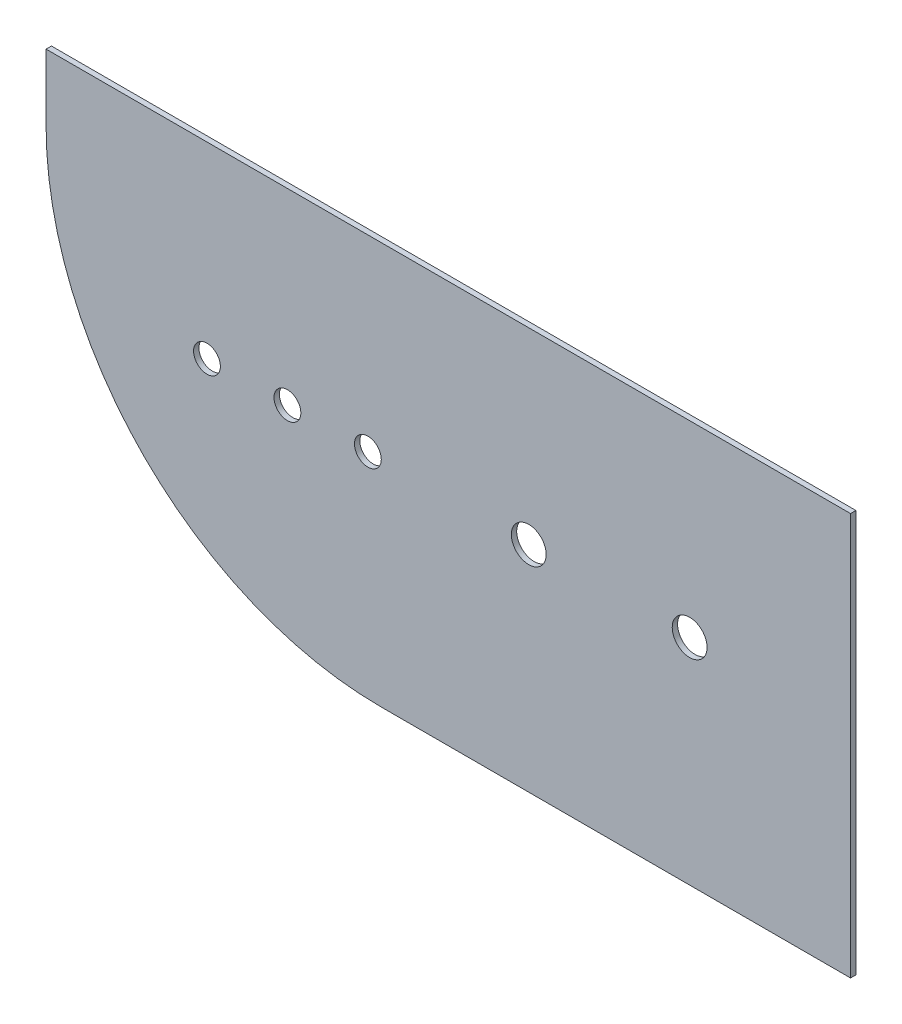
ISO-10303-21;
HEADER;
FILE_DESCRIPTION(('STEP AP214'),'2;1');
FILE_NAME('part.step','',(''),(''),'','','');
FILE_SCHEMA(('AUTOMOTIVE_DESIGN { 1 0 10303 214 1 1 1 1 }'));
ENDSEC;
DATA;
#1=APPLICATION_CONTEXT('core data for automotive mechanical design processes');
#2=APPLICATION_PROTOCOL_DEFINITION('international standard','automotive_design',2000,#1);
#3=PRODUCT_CONTEXT('',#1,'mechanical');
#4=PRODUCT('Part','Part','',(#3));
#5=PRODUCT_RELATED_PRODUCT_CATEGORY('part','',(#4));
#6=PRODUCT_DEFINITION_FORMATION('','',#4);
#7=PRODUCT_DEFINITION_CONTEXT('part definition',#1,'design');
#8=PRODUCT_DEFINITION('design','',#6,#7);
#9=PRODUCT_DEFINITION_SHAPE('','',#8);
#10=(LENGTH_UNIT() NAMED_UNIT(*) SI_UNIT(.MILLI.,.METRE.));
#11=(NAMED_UNIT(*) PLANE_ANGLE_UNIT() SI_UNIT($,.RADIAN.));
#12=(NAMED_UNIT(*) SI_UNIT($,.STERADIAN.) SOLID_ANGLE_UNIT());
#13=UNCERTAINTY_MEASURE_WITH_UNIT(LENGTH_MEASURE(1.E-05),#10,'distance_accuracy_value','');
#14=(GEOMETRIC_REPRESENTATION_CONTEXT(3) GLOBAL_UNCERTAINTY_ASSIGNED_CONTEXT((#13)) GLOBAL_UNIT_ASSIGNED_CONTEXT((#10,
#11,#12)) REPRESENTATION_CONTEXT('',''));
#15=CARTESIAN_POINT('',(0.,0.,0.));
#16=DIRECTION('',(0.,0.,1.));
#17=DIRECTION('',(1.,0.,0.));
#18=AXIS2_PLACEMENT_3D('',#15,#16,#17);
#19=CARTESIAN_POINT('',(-30.,-35.,0.));
#20=DIRECTION('',(0.,0.,1.));
#21=DIRECTION('',(1.,0.,0.));
#22=AXIS2_PLACEMENT_3D('',#19,#20,#21);
#23=CYLINDRICAL_SURFACE('',#22,3.25);
#24=CARTESIAN_POINT('',(-30.,-35.,1.));
#25=DIRECTION('',(0.,0.,-1.));
#26=DIRECTION('',(1.,0.,0.));
#27=AXIS2_PLACEMENT_3D('',#24,#25,#26);
#28=CIRCLE('',#27,3.25);
#29=CARTESIAN_POINT('',(-33.25,-35.,1.));
#30=VERTEX_POINT('',#29);
#31=EDGE_CURVE('E52',#30,#30,#28,.T.);
#32=ORIENTED_EDGE('',*,*,#31,.F.);
#33=DIRECTION('',(0.,0.,-1.));
#34=VECTOR('',#33,1.);
#35=CARTESIAN_POINT('',(-33.25,-35.,0.));
#36=LINE('',#35,#34);
#37=CARTESIAN_POINT('',(-33.25,-35.,0.));
#38=VERTEX_POINT('',#37);
#39=EDGE_CURVE('E11',#30,#38,#36,.T.);
#40=ORIENTED_EDGE('',*,*,#39,.T.);
#41=CARTESIAN_POINT('',(-30.,-35.,0.));
#42=DIRECTION('',(0.,0.,-1.));
#43=DIRECTION('',(1.,0.,0.));
#44=AXIS2_PLACEMENT_3D('',#41,#42,#43);
#45=CIRCLE('',#44,3.25);
#46=EDGE_CURVE('E44',#38,#38,#45,.T.);
#47=ORIENTED_EDGE('',*,*,#46,.T.);
#48=ORIENTED_EDGE('',*,*,#39,.F.);
#49=EDGE_LOOP('',(#32,#40,#47,#48));
#50=FACE_BOUND('',#49,.T.);
#51=ADVANCED_FACE('F34',(#50),#23,.F.);
#52=CARTESIAN_POINT('',(-150.,0.,0.));
#53=DIRECTION('',(-1.,0.,0.));
#54=DIRECTION('',(0.,0.,1.));
#55=AXIS2_PLACEMENT_3D('',#52,#53,#54);
#56=PLANE('',#55);
#57=DIRECTION('',(0.,-1.,0.));
#58=VECTOR('',#57,1.);
#59=CARTESIAN_POINT('',(-150.,0.,0.));
#60=LINE('',#59,#58);
#61=CARTESIAN_POINT('',(-150.,0.,0.));
#62=VERTEX_POINT('',#61);
#63=CARTESIAN_POINT('',(-150.,-12.5,0.));
#64=VERTEX_POINT('',#63);
#65=EDGE_CURVE('E90',#62,#64,#60,.T.);
#66=ORIENTED_EDGE('',*,*,#65,.T.);
#67=DIRECTION('',(0.,0.,1.));
#68=VECTOR('',#67,1.);
#69=CARTESIAN_POINT('',(-150.,-12.5,0.));
#70=LINE('',#69,#68);
#71=CARTESIAN_POINT('',(-150.,-12.5,1.));
#72=VERTEX_POINT('',#71);
#73=EDGE_CURVE('E81',#64,#72,#70,.T.);
#74=ORIENTED_EDGE('',*,*,#73,.T.);
#75=DIRECTION('',(0.,-1.,0.));
#76=VECTOR('',#75,1.);
#77=CARTESIAN_POINT('',(-150.,0.,1.));
#78=LINE('',#77,#76);
#79=CARTESIAN_POINT('',(-150.,0.,1.));
#80=VERTEX_POINT('',#79);
#81=EDGE_CURVE('E132',#80,#72,#78,.T.);
#82=ORIENTED_EDGE('',*,*,#81,.F.);
#83=DIRECTION('',(0.,0.,1.));
#84=VECTOR('',#83,1.);
#85=CARTESIAN_POINT('',(-150.,0.,0.));
#86=LINE('',#85,#84);
#87=EDGE_CURVE('E96',#62,#80,#86,.T.);
#88=ORIENTED_EDGE('',*,*,#87,.F.);
#89=EDGE_LOOP('',(#66,#74,#82,#88));
#90=FACE_BOUND('',#89,.T.);
#91=ADVANCED_FACE('F94',(#90),#56,.T.);
#92=CARTESIAN_POINT('',(0.,0.,0.));
#93=DIRECTION('',(0.,1.,0.));
#94=DIRECTION('',(1.,0.,0.));
#95=AXIS2_PLACEMENT_3D('',#92,#93,#94);
#96=PLANE('',#95);
#97=DIRECTION('',(-1.,0.,0.));
#98=VECTOR('',#97,1.);
#99=CARTESIAN_POINT('',(0.,0.,0.));
#100=LINE('',#99,#98);
#101=CARTESIAN_POINT('',(0.,0.,0.));
#102=VERTEX_POINT('',#101);
#103=EDGE_CURVE('E91',#102,#62,#100,.T.);
#104=ORIENTED_EDGE('',*,*,#103,.T.);
#105=ORIENTED_EDGE('',*,*,#87,.T.);
#106=DIRECTION('',(-1.,0.,0.));
#107=VECTOR('',#106,1.);
#108=CARTESIAN_POINT('',(0.,0.,1.));
#109=LINE('',#108,#107);
#110=CARTESIAN_POINT('',(0.,0.,1.));
#111=VERTEX_POINT('',#110);
#112=EDGE_CURVE('E134',#111,#80,#109,.T.);
#113=ORIENTED_EDGE('',*,*,#112,.F.);
#114=DIRECTION('',(0.,0.,1.));
#115=VECTOR('',#114,1.);
#116=CARTESIAN_POINT('',(0.,0.,0.));
#117=LINE('',#116,#115);
#118=EDGE_CURVE('E121',#102,#111,#117,.T.);
#119=ORIENTED_EDGE('',*,*,#118,.F.);
#120=EDGE_LOOP('',(#104,#105,#113,#119));
#121=FACE_BOUND('',#120,.T.);
#122=ADVANCED_FACE('F146',(#121),#96,.T.);
#123=CARTESIAN_POINT('',(0.,-75.,0.));
#124=DIRECTION('',(1.,0.,0.));
#125=DIRECTION('',(0.,1.,0.));
#126=AXIS2_PLACEMENT_3D('',#123,#124,#125);
#127=PLANE('',#126);
#128=DIRECTION('',(0.,1.,0.));
#129=VECTOR('',#128,1.);
#130=CARTESIAN_POINT('',(0.,-75.,0.));
#131=LINE('',#130,#129);
#132=CARTESIAN_POINT('',(0.,-75.,0.));
#133=VERTEX_POINT('',#132);
#134=EDGE_CURVE('E119',#133,#102,#131,.T.);
#135=ORIENTED_EDGE('',*,*,#134,.T.);
#136=ORIENTED_EDGE('',*,*,#118,.T.);
#137=DIRECTION('',(0.,1.,0.));
#138=VECTOR('',#137,1.);
#139=CARTESIAN_POINT('',(0.,-75.,1.));
#140=LINE('',#139,#138);
#141=CARTESIAN_POINT('',(0.,-75.,1.));
#142=VERTEX_POINT('',#141);
#143=EDGE_CURVE('E38',#142,#111,#140,.T.);
#144=ORIENTED_EDGE('',*,*,#143,.F.);
#145=DIRECTION('',(0.,0.,1.));
#146=VECTOR('',#145,1.);
#147=CARTESIAN_POINT('',(0.,-75.,0.));
#148=LINE('',#147,#146);
#149=EDGE_CURVE('E107',#133,#142,#148,.T.);
#150=ORIENTED_EDGE('',*,*,#149,.F.);
#151=EDGE_LOOP('',(#135,#136,#144,#150));
#152=FACE_BOUND('',#151,.T.);
#153=ADVANCED_FACE('F144',(#152),#127,.T.);
#154=CARTESIAN_POINT('',(-87.5,-75.,0.));
#155=DIRECTION('',(0.,-1.,0.));
#156=DIRECTION('',(-1.,0.,0.));
#157=AXIS2_PLACEMENT_3D('',#154,#155,#156);
#158=PLANE('',#157);
#159=DIRECTION('',(1.,0.,0.));
#160=VECTOR('',#159,1.);
#161=CARTESIAN_POINT('',(-87.5,-75.,0.));
#162=LINE('',#161,#160);
#163=CARTESIAN_POINT('',(-87.5,-75.,0.));
#164=VERTEX_POINT('',#163);
#165=EDGE_CURVE('E106',#164,#133,#162,.T.);
#166=ORIENTED_EDGE('',*,*,#165,.T.);
#167=ORIENTED_EDGE('',*,*,#149,.T.);
#168=DIRECTION('',(1.,0.,0.));
#169=VECTOR('',#168,1.);
#170=CARTESIAN_POINT('',(-87.5,-75.,1.));
#171=LINE('',#170,#169);
#172=CARTESIAN_POINT('',(-87.5,-75.,1.));
#173=VERTEX_POINT('',#172);
#174=EDGE_CURVE('E116',#173,#142,#171,.T.);
#175=ORIENTED_EDGE('',*,*,#174,.F.);
#176=DIRECTION('',(0.,0.,1.));
#177=VECTOR('',#176,1.);
#178=CARTESIAN_POINT('',(-87.5,-75.,0.));
#179=LINE('',#178,#177);
#180=EDGE_CURVE('E108',#164,#173,#179,.T.);
#181=ORIENTED_EDGE('',*,*,#180,.F.);
#182=EDGE_LOOP('',(#166,#167,#175,#181));
#183=FACE_BOUND('',#182,.T.);
#184=ADVANCED_FACE('F142',(#183),#158,.T.);
#185=CARTESIAN_POINT('',(-87.5,-12.5,0.));
#186=DIRECTION('',(0.,0.,1.));
#187=DIRECTION('',(-1.,0.,0.));
#188=AXIS2_PLACEMENT_3D('',#185,#186,#187);
#189=CYLINDRICAL_SURFACE('',#188,62.5);
#190=CARTESIAN_POINT('',(-87.5,-12.5,0.));
#191=DIRECTION('',(0.,0.,1.));
#192=DIRECTION('',(-1.,0.,0.));
#193=AXIS2_PLACEMENT_3D('',#190,#191,#192);
#194=CIRCLE('',#193,62.5);
#195=EDGE_CURVE('E86',#64,#164,#194,.T.);
#196=ORIENTED_EDGE('',*,*,#195,.T.);
#197=ORIENTED_EDGE('',*,*,#180,.T.);
#198=CARTESIAN_POINT('',(-87.5,-12.5,1.));
#199=DIRECTION('',(0.,0.,1.));
#200=DIRECTION('',(-1.,0.,0.));
#201=AXIS2_PLACEMENT_3D('',#198,#199,#200);
#202=CIRCLE('',#201,62.5);
#203=EDGE_CURVE('E88',#72,#173,#202,.T.);
#204=ORIENTED_EDGE('',*,*,#203,.F.);
#205=ORIENTED_EDGE('',*,*,#73,.F.);
#206=EDGE_LOOP('',(#196,#197,#204,#205));
#207=FACE_BOUND('',#206,.T.);
#208=ADVANCED_FACE('F83',(#207),#189,.T.);
#209=CARTESIAN_POINT('',(-75.,-37.5,1.));
#210=DIRECTION('',(0.,0.,1.));
#211=DIRECTION('',(1.,0.,0.));
#212=AXIS2_PLACEMENT_3D('',#209,#210,#211);
#213=PLANE('',#212);
#214=CARTESIAN_POINT('',(-120.,-35.,1.));
#215=DIRECTION('',(0.,0.,1.));
#216=DIRECTION('',(1.,0.,0.));
#217=AXIS2_PLACEMENT_3D('',#214,#215,#216);
#218=CIRCLE('',#217,2.5);
#219=CARTESIAN_POINT('',(-117.5,-35.,1.));
#220=VERTEX_POINT('',#219);
#221=EDGE_CURVE('E205',#220,#220,#218,.T.);
#222=ORIENTED_EDGE('',*,*,#221,.F.);
#223=EDGE_LOOP('',(#222));
#224=FACE_BOUND('',#223,.T.);
#225=CARTESIAN_POINT('',(-105.,-35.,1.));
#226=DIRECTION('',(0.,0.,1.));
#227=DIRECTION('',(1.,0.,0.));
#228=AXIS2_PLACEMENT_3D('',#225,#226,#227);
#229=CIRCLE('',#228,2.50000000000001);
#230=CARTESIAN_POINT('',(-102.5,-35.,1.));
#231=VERTEX_POINT('',#230);
#232=EDGE_CURVE('E202',#231,#231,#229,.T.);
#233=ORIENTED_EDGE('',*,*,#232,.F.);
#234=EDGE_LOOP('',(#233));
#235=FACE_BOUND('',#234,.T.);
#236=CARTESIAN_POINT('',(-90.,-35.,1.));
#237=DIRECTION('',(0.,0.,1.));
#238=DIRECTION('',(1.,0.,0.));
#239=AXIS2_PLACEMENT_3D('',#236,#237,#238);
#240=CIRCLE('',#239,2.5);
#241=CARTESIAN_POINT('',(-87.5,-35.,1.));
#242=VERTEX_POINT('',#241);
#243=EDGE_CURVE('E197',#242,#242,#240,.T.);
#244=ORIENTED_EDGE('',*,*,#243,.F.);
#245=EDGE_LOOP('',(#244));
#246=FACE_BOUND('',#245,.T.);
#247=CARTESIAN_POINT('',(-60.,-35.,1.));
#248=DIRECTION('',(0.,0.,1.));
#249=DIRECTION('',(1.,0.,0.));
#250=AXIS2_PLACEMENT_3D('',#247,#248,#249);
#251=CIRCLE('',#250,3.25);
#252=CARTESIAN_POINT('',(-56.75,-35.,1.));
#253=VERTEX_POINT('',#252);
#254=EDGE_CURVE('E192',#253,#253,#251,.T.);
#255=ORIENTED_EDGE('',*,*,#254,.F.);
#256=EDGE_LOOP('',(#255));
#257=FACE_BOUND('',#256,.T.);
#258=ORIENTED_EDGE('',*,*,#203,.T.);
#259=ORIENTED_EDGE('',*,*,#174,.T.);
#260=ORIENTED_EDGE('',*,*,#143,.T.);
#261=ORIENTED_EDGE('',*,*,#112,.T.);
#262=ORIENTED_EDGE('',*,*,#81,.T.);
#263=EDGE_LOOP('',(#258,#259,#260,#261,#262));
#264=FACE_BOUND('',#263,.T.);
#265=ORIENTED_EDGE('',*,*,#31,.T.);
#266=EDGE_LOOP('',(#265));
#267=FACE_BOUND('',#266,.T.);
#268=ADVANCED_FACE('F36',(#224,#235,#246,#257,#264,#267),#213,.T.);
#269=CARTESIAN_POINT('',(-75.,-37.5,0.));
#270=DIRECTION('',(0.,0.,1.));
#271=DIRECTION('',(1.,0.,0.));
#272=AXIS2_PLACEMENT_3D('',#269,#270,#271);
#273=PLANE('',#272);
#274=CARTESIAN_POINT('',(-120.,-35.,0.));
#275=DIRECTION('',(0.,0.,1.));
#276=DIRECTION('',(1.,0.,0.));
#277=AXIS2_PLACEMENT_3D('',#274,#275,#276);
#278=CIRCLE('',#277,2.5);
#279=CARTESIAN_POINT('',(-117.5,-35.,0.));
#280=VERTEX_POINT('',#279);
#281=EDGE_CURVE('E133',#280,#280,#278,.F.);
#282=ORIENTED_EDGE('',*,*,#281,.F.);
#283=EDGE_LOOP('',(#282));
#284=FACE_BOUND('',#283,.T.);
#285=CARTESIAN_POINT('',(-105.,-35.,0.));
#286=DIRECTION('',(0.,0.,1.));
#287=DIRECTION('',(1.,0.,0.));
#288=AXIS2_PLACEMENT_3D('',#285,#286,#287);
#289=CIRCLE('',#288,2.50000000000001);
#290=CARTESIAN_POINT('',(-102.5,-35.,0.));
#291=VERTEX_POINT('',#290);
#292=EDGE_CURVE('E184',#291,#291,#289,.F.);
#293=ORIENTED_EDGE('',*,*,#292,.F.);
#294=EDGE_LOOP('',(#293));
#295=FACE_BOUND('',#294,.T.);
#296=CARTESIAN_POINT('',(-90.,-35.,0.));
#297=DIRECTION('',(0.,0.,1.));
#298=DIRECTION('',(1.,0.,0.));
#299=AXIS2_PLACEMENT_3D('',#296,#297,#298);
#300=CIRCLE('',#299,2.5);
#301=CARTESIAN_POINT('',(-87.5,-35.,0.));
#302=VERTEX_POINT('',#301);
#303=EDGE_CURVE('E188',#302,#302,#300,.F.);
#304=ORIENTED_EDGE('',*,*,#303,.F.);
#305=EDGE_LOOP('',(#304));
#306=FACE_BOUND('',#305,.T.);
#307=CARTESIAN_POINT('',(-60.,-35.,0.));
#308=DIRECTION('',(0.,0.,1.));
#309=DIRECTION('',(1.,0.,0.));
#310=AXIS2_PLACEMENT_3D('',#307,#308,#309);
#311=CIRCLE('',#310,3.25);
#312=CARTESIAN_POINT('',(-56.75,-35.,0.));
#313=VERTEX_POINT('',#312);
#314=EDGE_CURVE('E191',#313,#313,#311,.F.);
#315=ORIENTED_EDGE('',*,*,#314,.F.);
#316=EDGE_LOOP('',(#315));
#317=FACE_BOUND('',#316,.T.);
#318=ORIENTED_EDGE('',*,*,#195,.F.);
#319=ORIENTED_EDGE('',*,*,#65,.F.);
#320=ORIENTED_EDGE('',*,*,#103,.F.);
#321=ORIENTED_EDGE('',*,*,#134,.F.);
#322=ORIENTED_EDGE('',*,*,#165,.F.);
#323=EDGE_LOOP('',(#318,#319,#320,#321,#322));
#324=FACE_BOUND('',#323,.T.);
#325=ORIENTED_EDGE('',*,*,#46,.F.);
#326=EDGE_LOOP('',(#325));
#327=FACE_BOUND('',#326,.T.);
#328=ADVANCED_FACE('F102',(#284,#295,#306,#317,#324,#327),#273,.F.);
#329=CARTESIAN_POINT('',(-60.,-35.,-9.19238815542513));
#330=DIRECTION('',(0.,0.,1.));
#331=DIRECTION('',(1.,0.,0.));
#332=AXIS2_PLACEMENT_3D('',#329,#330,#331);
#333=CYLINDRICAL_SURFACE('',#332,3.25);
#334=ORIENTED_EDGE('',*,*,#314,.T.);
#335=EDGE_LOOP('',(#334));
#336=FACE_BOUND('',#335,.T.);
#337=ORIENTED_EDGE('',*,*,#254,.T.);
#338=EDGE_LOOP('',(#337));
#339=FACE_BOUND('',#338,.T.);
#340=ADVANCED_FACE('F171',(#336,#339),#333,.F.);
#341=CARTESIAN_POINT('',(-90.,-35.,-9.19238815542513));
#342=DIRECTION('',(0.,0.,1.));
#343=DIRECTION('',(1.,0.,0.));
#344=AXIS2_PLACEMENT_3D('',#341,#342,#343);
#345=CYLINDRICAL_SURFACE('',#344,2.5);
#346=ORIENTED_EDGE('',*,*,#303,.T.);
#347=EDGE_LOOP('',(#346));
#348=FACE_BOUND('',#347,.T.);
#349=ORIENTED_EDGE('',*,*,#243,.T.);
#350=EDGE_LOOP('',(#349));
#351=FACE_BOUND('',#350,.T.);
#352=ADVANCED_FACE('F176',(#348,#351),#345,.F.);
#353=CARTESIAN_POINT('',(-105.,-35.,-9.19238815542513));
#354=DIRECTION('',(0.,0.,1.));
#355=DIRECTION('',(1.,0.,0.));
#356=AXIS2_PLACEMENT_3D('',#353,#354,#355);
#357=CYLINDRICAL_SURFACE('',#356,2.50000000000001);
#358=ORIENTED_EDGE('',*,*,#292,.T.);
#359=EDGE_LOOP('',(#358));
#360=FACE_BOUND('',#359,.T.);
#361=ORIENTED_EDGE('',*,*,#232,.T.);
#362=EDGE_LOOP('',(#361));
#363=FACE_BOUND('',#362,.T.);
#364=ADVANCED_FACE('F221',(#360,#363),#357,.F.);
#365=CARTESIAN_POINT('',(-120.,-35.,-9.19238815542513));
#366=DIRECTION('',(0.,0.,1.));
#367=DIRECTION('',(1.,0.,0.));
#368=AXIS2_PLACEMENT_3D('',#365,#366,#367);
#369=CYLINDRICAL_SURFACE('',#368,2.5);
#370=ORIENTED_EDGE('',*,*,#281,.T.);
#371=EDGE_LOOP('',(#370));
#372=FACE_BOUND('',#371,.T.);
#373=ORIENTED_EDGE('',*,*,#221,.T.);
#374=EDGE_LOOP('',(#373));
#375=FACE_BOUND('',#374,.T.);
#376=ADVANCED_FACE('F211',(#372,#375),#369,.F.);
#377=CLOSED_SHELL('',(#51,#91,#122,#153,#184,#208,#268,#328,#340,#352,#364,#376));
#378=MANIFOLD_SOLID_BREP('B2',#377);
#379=ADVANCED_BREP_SHAPE_REPRESENTATION('',(#18,#378),#14);
#380=SHAPE_DEFINITION_REPRESENTATION(#9,#379);
ENDSEC;
END-ISO-10303-21;
